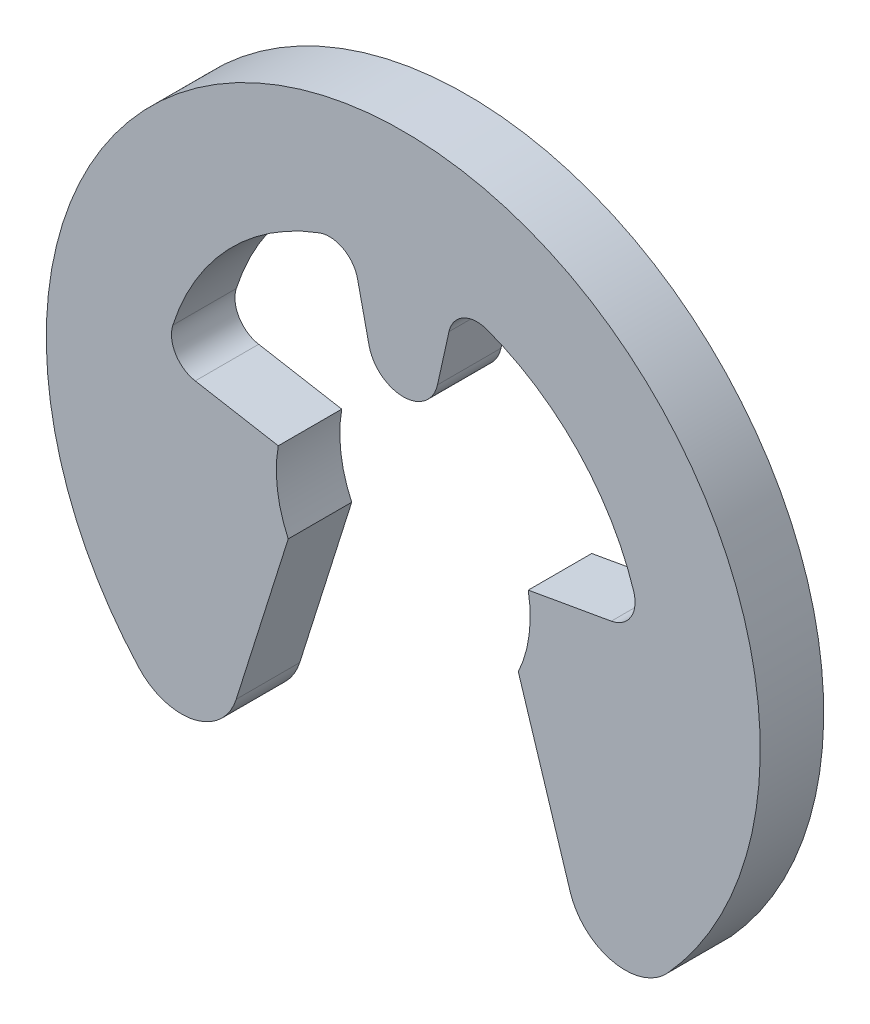
ISO-10303-21;
HEADER;
FILE_DESCRIPTION(('STEP AP214'),'2;1');
FILE_NAME('part.step','',(''),(''),'','','');
FILE_SCHEMA(('AUTOMOTIVE_DESIGN { 1 0 10303 214 1 1 1 1 }'));
ENDSEC;
DATA;
#1=APPLICATION_CONTEXT('core data for automotive mechanical design processes');
#2=APPLICATION_PROTOCOL_DEFINITION('international standard','automotive_design',2000,#1);
#3=PRODUCT_CONTEXT('',#1,'mechanical');
#4=PRODUCT('Part','Part','',(#3));
#5=PRODUCT_RELATED_PRODUCT_CATEGORY('part','',(#4));
#6=PRODUCT_DEFINITION_FORMATION('','',#4);
#7=PRODUCT_DEFINITION_CONTEXT('part definition',#1,'design');
#8=PRODUCT_DEFINITION('design','',#6,#7);
#9=PRODUCT_DEFINITION_SHAPE('','',#8);
#10=(LENGTH_UNIT() NAMED_UNIT(*) SI_UNIT(.MILLI.,.METRE.));
#11=(NAMED_UNIT(*) PLANE_ANGLE_UNIT() SI_UNIT($,.RADIAN.));
#12=(NAMED_UNIT(*) SI_UNIT($,.STERADIAN.) SOLID_ANGLE_UNIT());
#13=UNCERTAINTY_MEASURE_WITH_UNIT(LENGTH_MEASURE(1.E-05),#10,'distance_accuracy_value','');
#14=(GEOMETRIC_REPRESENTATION_CONTEXT(3) GLOBAL_UNCERTAINTY_ASSIGNED_CONTEXT((#13)) GLOBAL_UNIT_ASSIGNED_CONTEXT((#10,
#11,#12)) REPRESENTATION_CONTEXT('',''));
#15=CARTESIAN_POINT('',(0.,0.,0.));
#16=DIRECTION('',(0.,0.,1.));
#17=DIRECTION('',(1.,0.,0.));
#18=AXIS2_PLACEMENT_3D('',#15,#16,#17);
#19=CARTESIAN_POINT('',(0.,0.,-0.2));
#20=DIRECTION('',(0.,0.,1.));
#21=DIRECTION('',(1.,0.,0.));
#22=AXIS2_PLACEMENT_3D('',#19,#20,#21);
#23=CYLINDRICAL_SURFACE('',#22,0.399999999999999);
#24=CARTESIAN_POINT('',(0.,0.,0.));
#25=DIRECTION('',(0.,0.,-1.));
#26=DIRECTION('',(1.,0.,0.));
#27=AXIS2_PLACEMENT_3D('',#24,#25,#26);
#28=CIRCLE('',#27,0.399999999999999);
#29=CARTESIAN_POINT('',(0.393923101204882,0.069459271066771,0.));
#30=VERTEX_POINT('',#29);
#31=CARTESIAN_POINT('',(0.36252311481466,-0.169047304696281,0.));
#32=VERTEX_POINT('',#31);
#33=EDGE_CURVE('E190',#30,#32,#28,.T.);
#34=ORIENTED_EDGE('',*,*,#33,.F.);
#35=DIRECTION('',(0.,0.,1.));
#36=VECTOR('',#35,1.);
#37=CARTESIAN_POINT('',(0.393923101204882,0.069459271066771,-0.2));
#38=LINE('',#37,#36);
#39=CARTESIAN_POINT('',(0.393923101204882,0.069459271066771,-0.2));
#40=VERTEX_POINT('',#39);
#41=EDGE_CURVE('E11',#40,#30,#38,.T.);
#42=ORIENTED_EDGE('',*,*,#41,.F.);
#43=CARTESIAN_POINT('',(0.,0.,-0.2));
#44=DIRECTION('',(0.,0.,-1.));
#45=DIRECTION('',(1.,0.,0.));
#46=AXIS2_PLACEMENT_3D('',#43,#44,#45);
#47=CIRCLE('',#46,0.399999999999999);
#48=CARTESIAN_POINT('',(0.36252311481466,-0.169047304696281,-0.2));
#49=VERTEX_POINT('',#48);
#50=EDGE_CURVE('E240',#40,#49,#47,.T.);
#51=ORIENTED_EDGE('',*,*,#50,.T.);
#52=DIRECTION('',(0.,0.,1.));
#53=VECTOR('',#52,1.);
#54=CARTESIAN_POINT('',(0.36252311481466,-0.169047304696281,-0.2));
#55=LINE('',#54,#53);
#56=EDGE_CURVE('E36',#49,#32,#55,.T.);
#57=ORIENTED_EDGE('',*,*,#56,.T.);
#58=EDGE_LOOP('',(#34,#42,#51,#57));
#59=FACE_BOUND('',#58,.T.);
#60=ADVANCED_FACE('F33',(#59),#23,.F.);
#61=CARTESIAN_POINT('',(0.393923101204882,0.069459271066771,-0.2));
#62=DIRECTION('',(-0.173648177666926,0.984807753012209,0.));
#63=DIRECTION('',(-0.984807753012209,-0.173648177666926,0.));
#64=AXIS2_PLACEMENT_3D('',#61,#62,#63);
#65=PLANE('',#64);
#66=DIRECTION('',(-0.984807753012209,-0.173648177666927,0.));
#67=VECTOR('',#66,1.);
#68=CARTESIAN_POINT('',(0.393923101204882,0.069459271066771,0.));
#69=LINE('',#68,#67);
#70=CARTESIAN_POINT('',(0.655621015172542,0.115603674094391,0.));
#71=VERTEX_POINT('',#70);
#72=EDGE_CURVE('E238',#71,#30,#69,.T.);
#73=ORIENTED_EDGE('',*,*,#72,.F.);
#74=DIRECTION('',(0.,0.,1.));
#75=VECTOR('',#74,1.);
#76=CARTESIAN_POINT('',(0.655621015172542,0.115603674094391,-0.2));
#77=LINE('',#76,#75);
#78=CARTESIAN_POINT('',(0.655621015172542,0.115603674094391,-0.2));
#79=VERTEX_POINT('',#78);
#80=EDGE_CURVE('E42',#79,#71,#77,.T.);
#81=ORIENTED_EDGE('',*,*,#80,.F.);
#82=DIRECTION('',(-0.984807753012209,-0.173648177666927,0.));
#83=VECTOR('',#82,1.);
#84=CARTESIAN_POINT('',(0.393923101204882,0.069459271066771,-0.2));
#85=LINE('',#84,#83);
#86=EDGE_CURVE('E180',#79,#40,#85,.T.);
#87=ORIENTED_EDGE('',*,*,#86,.T.);
#88=ORIENTED_EDGE('',*,*,#41,.T.);
#89=EDGE_LOOP('',(#73,#81,#87,#88));
#90=FACE_BOUND('',#89,.T.);
#91=ADVANCED_FACE('F272',(#90),#65,.T.);
#92=CARTESIAN_POINT('',(0.639884149071478,0.204851876711123,-0.2));
#93=DIRECTION('',(0.,0.,1.));
#94=DIRECTION('',(1.,0.,0.));
#95=AXIS2_PLACEMENT_3D('',#92,#93,#94);
#96=CYLINDRICAL_SURFACE('',#95,0.0906250000000004);
#97=CARTESIAN_POINT('',(0.639884149071478,0.204851876711123,0.));
#98=DIRECTION('',(0.,0.,-1.));
#99=DIRECTION('',(1.,0.,0.));
#100=AXIS2_PLACEMENT_3D('',#97,#98,#99);
#101=CIRCLE('',#100,0.0906250000000004);
#102=CARTESIAN_POINT('',(0.726194104062515,0.23248306008146,0.));
#103=VERTEX_POINT('',#102);
#104=EDGE_CURVE('E167',#103,#71,#101,.T.);
#105=ORIENTED_EDGE('',*,*,#104,.F.);
#106=DIRECTION('',(0.,0.,1.));
#107=VECTOR('',#106,1.);
#108=CARTESIAN_POINT('',(0.726194104062515,0.23248306008146,-0.2));
#109=LINE('',#108,#107);
#110=CARTESIAN_POINT('',(0.726194104062515,0.23248306008146,-0.2));
#111=VERTEX_POINT('',#110);
#112=EDGE_CURVE('E162',#111,#103,#109,.T.);
#113=ORIENTED_EDGE('',*,*,#112,.F.);
#114=CARTESIAN_POINT('',(0.639884149071478,0.204851876711123,-0.2));
#115=DIRECTION('',(0.,0.,-1.));
#116=DIRECTION('',(1.,0.,0.));
#117=AXIS2_PLACEMENT_3D('',#114,#115,#116);
#118=CIRCLE('',#117,0.0906250000000004);
#119=EDGE_CURVE('E165',#111,#79,#118,.T.);
#120=ORIENTED_EDGE('',*,*,#119,.T.);
#121=ORIENTED_EDGE('',*,*,#80,.T.);
#122=EDGE_LOOP('',(#105,#113,#120,#121));
#123=FACE_BOUND('',#122,.T.);
#124=ADVANCED_FACE('F164',(#123),#96,.F.);
#125=CARTESIAN_POINT('',(0.,0.,-0.2));
#126=DIRECTION('',(0.,0.,1.));
#127=DIRECTION('',(1.,0.,0.));
#128=AXIS2_PLACEMENT_3D('',#125,#126,#127);
#129=CYLINDRICAL_SURFACE('',#128,0.7625);
#130=CARTESIAN_POINT('',(0.,0.,0.));
#131=DIRECTION('',(0.,0.,-1.));
#132=DIRECTION('',(1.,0.,0.));
#133=AXIS2_PLACEMENT_3D('',#130,#131,#132);
#134=CIRCLE('',#133,0.7625);
#135=CARTESIAN_POINT('',(0.26393792964982,0.715362159533314,0.));
#136=VERTEX_POINT('',#135);
#137=EDGE_CURVE('E235',#136,#103,#134,.T.);
#138=ORIENTED_EDGE('',*,*,#137,.F.);
#139=DIRECTION('',(0.,0.,1.));
#140=VECTOR('',#139,1.);
#141=CARTESIAN_POINT('',(0.26393792964982,0.715362159533314,-0.2));
#142=LINE('',#141,#140);
#143=CARTESIAN_POINT('',(0.26393792964982,0.715362159533314,-0.2));
#144=VERTEX_POINT('',#143);
#145=EDGE_CURVE('E172',#144,#136,#142,.T.);
#146=ORIENTED_EDGE('',*,*,#145,.F.);
#147=CARTESIAN_POINT('',(0.,0.,-0.2));
#148=DIRECTION('',(0.,0.,-1.));
#149=DIRECTION('',(1.,0.,0.));
#150=AXIS2_PLACEMENT_3D('',#147,#148,#149);
#151=CIRCLE('',#150,0.7625);
#152=EDGE_CURVE('E178',#144,#111,#151,.T.);
#153=ORIENTED_EDGE('',*,*,#152,.T.);
#154=ORIENTED_EDGE('',*,*,#112,.T.);
#155=EDGE_LOOP('',(#138,#146,#153,#154));
#156=FACE_BOUND('',#155,.T.);
#157=ADVANCED_FACE('F182',(#156),#129,.F.);
#158=CARTESIAN_POINT('',(0.232568257683243,0.630339607785501,-0.2));
#159=DIRECTION('',(0.,0.,1.));
#160=DIRECTION('',(1.,0.,0.));
#161=AXIS2_PLACEMENT_3D('',#158,#159,#160);
#162=CYLINDRICAL_SURFACE('',#161,0.0906250000000003);
#163=CARTESIAN_POINT('',(0.232568257683243,0.630339607785501,0.));
#164=DIRECTION('',(0.,0.,-1.));
#165=DIRECTION('',(1.,0.,0.));
#166=AXIS2_PLACEMENT_3D('',#163,#164,#165);
#167=CIRCLE('',#166,0.0906250000000003);
#168=CARTESIAN_POINT('',(0.144091432037999,0.649954447798643,0.));
#169=VERTEX_POINT('',#168);
#170=EDGE_CURVE('E232',#169,#136,#167,.T.);
#171=ORIENTED_EDGE('',*,*,#170,.F.);
#172=DIRECTION('',(0.,0.,1.));
#173=VECTOR('',#172,1.);
#174=CARTESIAN_POINT('',(0.144091432037999,0.649954447798643,-0.2));
#175=LINE('',#174,#173);
#176=CARTESIAN_POINT('',(0.144091432037999,0.649954447798643,-0.2));
#177=VERTEX_POINT('',#176);
#178=EDGE_CURVE('E244',#177,#169,#175,.T.);
#179=ORIENTED_EDGE('',*,*,#178,.F.);
#180=CARTESIAN_POINT('',(0.232568257683243,0.630339607785501,-0.2));
#181=DIRECTION('',(0.,0.,-1.));
#182=DIRECTION('',(1.,0.,0.));
#183=AXIS2_PLACEMENT_3D('',#180,#181,#182);
#184=CIRCLE('',#183,0.0906250000000003);
#185=EDGE_CURVE('E183',#177,#144,#184,.T.);
#186=ORIENTED_EDGE('',*,*,#185,.T.);
#187=ORIENTED_EDGE('',*,*,#145,.T.);
#188=EDGE_LOOP('',(#171,#179,#186,#187));
#189=FACE_BOUND('',#188,.T.);
#190=ADVANCED_FACE('F285',(#189),#162,.F.);
#191=CARTESIAN_POINT('',(0.107871267935006,0.486575845575241,-0.2));
#192=DIRECTION('',(0.976296007119932,-0.216439613938109,0.));
#193=DIRECTION('',(0.216439613938109,0.976296007119932,0.));
#194=AXIS2_PLACEMENT_3D('',#191,#192,#193);
#195=PLANE('',#194);
#196=DIRECTION('',(0.216439613938109,0.976296007119932,0.));
#197=VECTOR('',#196,1.);
#198=CARTESIAN_POINT('',(0.107871267935006,0.486575845575241,0.));
#199=LINE('',#198,#197);
#200=CARTESIAN_POINT('',(0.107871267935006,0.486575845575241,0.));
#201=VERTEX_POINT('',#200);
#202=EDGE_CURVE('E229',#201,#169,#199,.T.);
#203=ORIENTED_EDGE('',*,*,#202,.F.);
#204=DIRECTION('',(0.,0.,1.));
#205=VECTOR('',#204,1.);
#206=CARTESIAN_POINT('',(0.107871267935006,0.486575845575241,-0.2));
#207=LINE('',#206,#205);
#208=CARTESIAN_POINT('',(0.107871267935006,0.486575845575241,-0.2));
#209=VERTEX_POINT('',#208);
#210=EDGE_CURVE('E246',#209,#201,#207,.T.);
#211=ORIENTED_EDGE('',*,*,#210,.F.);
#212=DIRECTION('',(0.216439613938109,0.976296007119932,0.));
#213=VECTOR('',#212,1.);
#214=CARTESIAN_POINT('',(0.107871267935006,0.486575845575241,-0.2));
#215=LINE('',#214,#213);
#216=EDGE_CURVE('E185',#209,#177,#215,.T.);
#217=ORIENTED_EDGE('',*,*,#216,.T.);
#218=ORIENTED_EDGE('',*,*,#178,.T.);
#219=EDGE_LOOP('',(#203,#211,#217,#218));
#220=FACE_BOUND('',#219,.T.);
#221=ADVANCED_FACE('F288',(#220),#195,.T.);
#222=CARTESIAN_POINT('',(0.,0.510490329928958,-0.2));
#223=DIRECTION('',(0.,0.,1.));
#224=DIRECTION('',(1.,0.,0.));
#225=AXIS2_PLACEMENT_3D('',#222,#223,#224);
#226=CYLINDRICAL_SURFACE('',#225,0.110490329928959);
#227=CARTESIAN_POINT('',(0.,0.510490329928958,0.));
#228=DIRECTION('',(0.,0.,1.));
#229=DIRECTION('',(1.,0.,0.));
#230=AXIS2_PLACEMENT_3D('',#227,#228,#229);
#231=CIRCLE('',#230,0.110490329928959);
#232=CARTESIAN_POINT('',(-0.107871267935006,0.486575845575241,0.));
#233=VERTEX_POINT('',#232);
#234=EDGE_CURVE('E226',#233,#201,#231,.T.);
#235=ORIENTED_EDGE('',*,*,#234,.F.);
#236=DIRECTION('',(0.,0.,1.));
#237=VECTOR('',#236,1.);
#238=CARTESIAN_POINT('',(-0.107871267935006,0.486575845575241,-0.2));
#239=LINE('',#238,#237);
#240=CARTESIAN_POINT('',(-0.107871267935006,0.486575845575241,-0.2));
#241=VERTEX_POINT('',#240);
#242=EDGE_CURVE('E248',#241,#233,#239,.T.);
#243=ORIENTED_EDGE('',*,*,#242,.F.);
#244=CARTESIAN_POINT('',(0.,0.510490329928958,-0.2));
#245=DIRECTION('',(0.,0.,1.));
#246=DIRECTION('',(1.,0.,0.));
#247=AXIS2_PLACEMENT_3D('',#244,#245,#246);
#248=CIRCLE('',#247,0.110490329928959);
#249=EDGE_CURVE('E496',#241,#209,#248,.T.);
#250=ORIENTED_EDGE('',*,*,#249,.T.);
#251=ORIENTED_EDGE('',*,*,#210,.T.);
#252=EDGE_LOOP('',(#235,#243,#250,#251));
#253=FACE_BOUND('',#252,.T.);
#254=ADVANCED_FACE('F292',(#253),#226,.T.);
#255=CARTESIAN_POINT('',(-0.107871267935007,0.486575845575241,-0.2));
#256=DIRECTION('',(-0.976296007119933,-0.216439613938104,0.));
#257=DIRECTION('',(0.216439613938104,-0.976296007119933,0.));
#258=AXIS2_PLACEMENT_3D('',#255,#256,#257);
#259=PLANE('',#258);
#260=DIRECTION('',(0.216439613938104,-0.976296007119933,0.));
#261=VECTOR('',#260,1.);
#262=CARTESIAN_POINT('',(-0.107871267935007,0.486575845575241,0.));
#263=LINE('',#262,#261);
#264=CARTESIAN_POINT('',(-0.144091432037999,0.649954447798643,0.));
#265=VERTEX_POINT('',#264);
#266=EDGE_CURVE('E223',#265,#233,#263,.T.);
#267=ORIENTED_EDGE('',*,*,#266,.F.);
#268=DIRECTION('',(0.,0.,1.));
#269=VECTOR('',#268,1.);
#270=CARTESIAN_POINT('',(-0.144091432037999,0.649954447798643,-0.2));
#271=LINE('',#270,#269);
#272=CARTESIAN_POINT('',(-0.144091432037999,0.649954447798643,-0.2));
#273=VERTEX_POINT('',#272);
#274=EDGE_CURVE('E250',#273,#265,#271,.T.);
#275=ORIENTED_EDGE('',*,*,#274,.F.);
#276=DIRECTION('',(0.216439613938104,-0.976296007119933,0.));
#277=VECTOR('',#276,1.);
#278=CARTESIAN_POINT('',(-0.107871267935007,0.486575845575241,-0.2));
#279=LINE('',#278,#277);
#280=EDGE_CURVE('E500',#273,#241,#279,.T.);
#281=ORIENTED_EDGE('',*,*,#280,.T.);
#282=ORIENTED_EDGE('',*,*,#242,.T.);
#283=EDGE_LOOP('',(#267,#275,#281,#282));
#284=FACE_BOUND('',#283,.T.);
#285=ADVANCED_FACE('F296',(#284),#259,.T.);
#286=CARTESIAN_POINT('',(-0.232568257683243,0.630339607785501,-0.2));
#287=DIRECTION('',(0.,0.,1.));
#288=DIRECTION('',(1.,0.,0.));
#289=AXIS2_PLACEMENT_3D('',#286,#287,#288);
#290=CYLINDRICAL_SURFACE('',#289,0.0906250000000003);
#291=CARTESIAN_POINT('',(-0.232568257683243,0.630339607785501,0.));
#292=DIRECTION('',(0.,0.,-1.));
#293=DIRECTION('',(1.,0.,0.));
#294=AXIS2_PLACEMENT_3D('',#291,#292,#293);
#295=CIRCLE('',#294,0.0906250000000003);
#296=CARTESIAN_POINT('',(-0.26393792964982,0.715362159533313,0.));
#297=VERTEX_POINT('',#296);
#298=EDGE_CURVE('E220',#297,#265,#295,.T.);
#299=ORIENTED_EDGE('',*,*,#298,.F.);
#300=DIRECTION('',(0.,0.,1.));
#301=VECTOR('',#300,1.);
#302=CARTESIAN_POINT('',(-0.26393792964982,0.715362159533313,-0.2));
#303=LINE('',#302,#301);
#304=CARTESIAN_POINT('',(-0.26393792964982,0.715362159533313,-0.2));
#305=VERTEX_POINT('',#304);
#306=EDGE_CURVE('E252',#305,#297,#303,.T.);
#307=ORIENTED_EDGE('',*,*,#306,.F.);
#308=CARTESIAN_POINT('',(-0.232568257683243,0.630339607785501,-0.2));
#309=DIRECTION('',(0.,0.,-1.));
#310=DIRECTION('',(1.,0.,0.));
#311=AXIS2_PLACEMENT_3D('',#308,#309,#310);
#312=CIRCLE('',#311,0.0906250000000003);
#313=EDGE_CURVE('E489',#305,#273,#312,.T.);
#314=ORIENTED_EDGE('',*,*,#313,.T.);
#315=ORIENTED_EDGE('',*,*,#274,.T.);
#316=EDGE_LOOP('',(#299,#307,#314,#315));
#317=FACE_BOUND('',#316,.T.);
#318=ADVANCED_FACE('F300',(#317),#290,.F.);
#319=CARTESIAN_POINT('',(0.,0.,-0.2));
#320=DIRECTION('',(0.,0.,1.));
#321=DIRECTION('',(1.,0.,0.));
#322=AXIS2_PLACEMENT_3D('',#319,#320,#321);
#323=CYLINDRICAL_SURFACE('',#322,0.7625);
#324=CARTESIAN_POINT('',(0.,0.,0.));
#325=DIRECTION('',(0.,0.,-1.));
#326=DIRECTION('',(1.,0.,0.));
#327=AXIS2_PLACEMENT_3D('',#324,#325,#326);
#328=CIRCLE('',#327,0.7625);
#329=CARTESIAN_POINT('',(-0.726194104062515,0.23248306008146,0.));
#330=VERTEX_POINT('',#329);
#331=EDGE_CURVE('E217',#330,#297,#328,.T.);
#332=ORIENTED_EDGE('',*,*,#331,.F.);
#333=DIRECTION('',(0.,0.,1.));
#334=VECTOR('',#333,1.);
#335=CARTESIAN_POINT('',(-0.726194104062515,0.23248306008146,-0.2));
#336=LINE('',#335,#334);
#337=CARTESIAN_POINT('',(-0.726194104062515,0.23248306008146,-0.2));
#338=VERTEX_POINT('',#337);
#339=EDGE_CURVE('E254',#338,#330,#336,.T.);
#340=ORIENTED_EDGE('',*,*,#339,.F.);
#341=CARTESIAN_POINT('',(0.,0.,-0.2));
#342=DIRECTION('',(0.,0.,-1.));
#343=DIRECTION('',(1.,0.,0.));
#344=AXIS2_PLACEMENT_3D('',#341,#342,#343);
#345=CIRCLE('',#344,0.7625);
#346=EDGE_CURVE('E485',#338,#305,#345,.T.);
#347=ORIENTED_EDGE('',*,*,#346,.T.);
#348=ORIENTED_EDGE('',*,*,#306,.T.);
#349=EDGE_LOOP('',(#332,#340,#347,#348));
#350=FACE_BOUND('',#349,.T.);
#351=ADVANCED_FACE('F304',(#350),#323,.F.);
#352=CARTESIAN_POINT('',(-0.639884149071478,0.204851876711123,-0.2));
#353=DIRECTION('',(0.,0.,1.));
#354=DIRECTION('',(1.,0.,0.));
#355=AXIS2_PLACEMENT_3D('',#352,#353,#354);
#356=CYLINDRICAL_SURFACE('',#355,0.0906250000000004);
#357=CARTESIAN_POINT('',(-0.639884149071478,0.204851876711123,0.));
#358=DIRECTION('',(0.,0.,-1.));
#359=DIRECTION('',(1.,0.,0.));
#360=AXIS2_PLACEMENT_3D('',#357,#358,#359);
#361=CIRCLE('',#360,0.0906250000000004);
#362=CARTESIAN_POINT('',(-0.655621015172542,0.115603674094391,0.));
#363=VERTEX_POINT('',#362);
#364=EDGE_CURVE('E214',#363,#330,#361,.T.);
#365=ORIENTED_EDGE('',*,*,#364,.F.);
#366=DIRECTION('',(0.,0.,1.));
#367=VECTOR('',#366,1.);
#368=CARTESIAN_POINT('',(-0.655621015172542,0.115603674094391,-0.2));
#369=LINE('',#368,#367);
#370=CARTESIAN_POINT('',(-0.655621015172542,0.115603674094391,-0.2));
#371=VERTEX_POINT('',#370);
#372=EDGE_CURVE('E256',#371,#363,#369,.T.);
#373=ORIENTED_EDGE('',*,*,#372,.F.);
#374=CARTESIAN_POINT('',(-0.639884149071478,0.204851876711123,-0.2));
#375=DIRECTION('',(0.,0.,-1.));
#376=DIRECTION('',(1.,0.,0.));
#377=AXIS2_PLACEMENT_3D('',#374,#375,#376);
#378=CIRCLE('',#377,0.0906250000000004);
#379=EDGE_CURVE('E506',#371,#338,#378,.T.);
#380=ORIENTED_EDGE('',*,*,#379,.T.);
#381=ORIENTED_EDGE('',*,*,#339,.T.);
#382=EDGE_LOOP('',(#365,#373,#380,#381));
#383=FACE_BOUND('',#382,.T.);
#384=ADVANCED_FACE('F308',(#383),#356,.F.);
#385=CARTESIAN_POINT('',(-0.393923101204882,0.069459271066771,-0.2));
#386=DIRECTION('',(0.173648177666926,0.984807753012209,0.));
#387=DIRECTION('',(-0.984807753012209,0.173648177666926,0.));
#388=AXIS2_PLACEMENT_3D('',#385,#386,#387);
#389=PLANE('',#388);
#390=DIRECTION('',(-0.984807753012209,0.173648177666927,0.));
#391=VECTOR('',#390,1.);
#392=CARTESIAN_POINT('',(-0.393923101204882,0.069459271066771,0.));
#393=LINE('',#392,#391);
#394=CARTESIAN_POINT('',(-0.393923101204882,0.069459271066771,0.));
#395=VERTEX_POINT('',#394);
#396=EDGE_CURVE('E211',#395,#363,#393,.T.);
#397=ORIENTED_EDGE('',*,*,#396,.F.);
#398=DIRECTION('',(0.,0.,1.));
#399=VECTOR('',#398,1.);
#400=CARTESIAN_POINT('',(-0.393923101204882,0.069459271066771,-0.2));
#401=LINE('',#400,#399);
#402=CARTESIAN_POINT('',(-0.393923101204882,0.069459271066771,-0.2));
#403=VERTEX_POINT('',#402);
#404=EDGE_CURVE('E258',#403,#395,#401,.T.);
#405=ORIENTED_EDGE('',*,*,#404,.F.);
#406=DIRECTION('',(-0.984807753012209,0.173648177666927,0.));
#407=VECTOR('',#406,1.);
#408=CARTESIAN_POINT('',(-0.393923101204882,0.069459271066771,-0.2));
#409=LINE('',#408,#407);
#410=EDGE_CURVE('E478',#403,#371,#409,.T.);
#411=ORIENTED_EDGE('',*,*,#410,.T.);
#412=ORIENTED_EDGE('',*,*,#372,.T.);
#413=EDGE_LOOP('',(#397,#405,#411,#412));
#414=FACE_BOUND('',#413,.T.);
#415=ADVANCED_FACE('F312',(#414),#389,.T.);
#416=CARTESIAN_POINT('',(0.,0.,-0.2));
#417=DIRECTION('',(0.,0.,1.));
#418=DIRECTION('',(1.,0.,0.));
#419=AXIS2_PLACEMENT_3D('',#416,#417,#418);
#420=CYLINDRICAL_SURFACE('',#419,0.399999999999999);
#421=CARTESIAN_POINT('',(0.,0.,0.));
#422=DIRECTION('',(0.,0.,-1.));
#423=DIRECTION('',(1.,0.,0.));
#424=AXIS2_PLACEMENT_3D('',#421,#422,#423);
#425=CIRCLE('',#424,0.399999999999999);
#426=CARTESIAN_POINT('',(-0.362523114814659,-0.169047304696281,0.));
#427=VERTEX_POINT('',#426);
#428=EDGE_CURVE('E208',#427,#395,#425,.T.);
#429=ORIENTED_EDGE('',*,*,#428,.F.);
#430=DIRECTION('',(0.,0.,1.));
#431=VECTOR('',#430,1.);
#432=CARTESIAN_POINT('',(-0.362523114814659,-0.169047304696281,-0.2));
#433=LINE('',#432,#431);
#434=CARTESIAN_POINT('',(-0.362523114814659,-0.169047304696281,-0.2));
#435=VERTEX_POINT('',#434);
#436=EDGE_CURVE('E260',#435,#427,#433,.T.);
#437=ORIENTED_EDGE('',*,*,#436,.F.);
#438=CARTESIAN_POINT('',(0.,0.,-0.2));
#439=DIRECTION('',(0.,0.,-1.));
#440=DIRECTION('',(1.,0.,0.));
#441=AXIS2_PLACEMENT_3D('',#438,#439,#440);
#442=CIRCLE('',#441,0.399999999999999);
#443=EDGE_CURVE('E474',#435,#403,#442,.T.);
#444=ORIENTED_EDGE('',*,*,#443,.T.);
#445=ORIENTED_EDGE('',*,*,#404,.T.);
#446=EDGE_LOOP('',(#429,#437,#444,#445));
#447=FACE_BOUND('',#446,.T.);
#448=ADVANCED_FACE('F316',(#447),#420,.F.);
#449=CARTESIAN_POINT('',(-0.36252311481466,-0.169047304696281,-0.2));
#450=DIRECTION('',(0.953716950748226,-0.300705799504276,0.));
#451=DIRECTION('',(0.300705799504276,0.953716950748226,0.));
#452=AXIS2_PLACEMENT_3D('',#449,#450,#451);
#453=PLANE('',#452);
#454=DIRECTION('',(0.300705799504276,0.953716950748226,0.));
#455=VECTOR('',#454,1.);
#456=CARTESIAN_POINT('',(-0.36252311481466,-0.169047304696281,0.));
#457=LINE('',#456,#455);
#458=CARTESIAN_POINT('',(-0.526283246387881,-0.688428086828221,0.));
#459=VERTEX_POINT('',#458);
#460=EDGE_CURVE('E205',#459,#427,#457,.T.);
#461=ORIENTED_EDGE('',*,*,#460,.F.);
#462=DIRECTION('',(0.,0.,1.));
#463=VECTOR('',#462,1.);
#464=CARTESIAN_POINT('',(-0.526283246387881,-0.688428086828221,-0.2));
#465=LINE('',#464,#463);
#466=CARTESIAN_POINT('',(-0.526283246387881,-0.688428086828221,-0.2));
#467=VERTEX_POINT('',#466);
#468=EDGE_CURVE('E262',#467,#459,#465,.T.);
#469=ORIENTED_EDGE('',*,*,#468,.F.);
#470=DIRECTION('',(0.300705799504276,0.953716950748226,0.));
#471=VECTOR('',#470,1.);
#472=CARTESIAN_POINT('',(-0.36252311481466,-0.169047304696281,-0.2));
#473=LINE('',#472,#471);
#474=EDGE_CURVE('E510',#467,#435,#473,.T.);
#475=ORIENTED_EDGE('',*,*,#474,.T.);
#476=ORIENTED_EDGE('',*,*,#436,.T.);
#477=EDGE_LOOP('',(#461,#469,#475,#476));
#478=FACE_BOUND('',#477,.T.);
#479=ADVANCED_FACE('F320',(#478),#453,.T.);
#480=CARTESIAN_POINT('',(-0.699144443710999,-0.633925160668071,-0.2));
#481=DIRECTION('',(0.,0.,1.));
#482=DIRECTION('',(1.,0.,0.));
#483=AXIS2_PLACEMENT_3D('',#480,#481,#482);
#484=CYLINDRICAL_SURFACE('',#483,0.181250000000001);
#485=CARTESIAN_POINT('',(-0.699144443710999,-0.633925160668071,0.));
#486=DIRECTION('',(0.,0.,1.));
#487=DIRECTION('',(1.,0.,0.));
#488=AXIS2_PLACEMENT_3D('',#485,#486,#487);
#489=CIRCLE('',#488,0.181250000000001);
#490=CARTESIAN_POINT('',(-0.833417217668741,-0.755672376955317,0.));
#491=VERTEX_POINT('',#490);
#492=EDGE_CURVE('E202',#491,#459,#489,.T.);
#493=ORIENTED_EDGE('',*,*,#492,.F.);
#494=DIRECTION('',(0.,0.,1.));
#495=VECTOR('',#494,1.);
#496=CARTESIAN_POINT('',(-0.833417217668741,-0.755672376955317,-0.2));
#497=LINE('',#496,#495);
#498=CARTESIAN_POINT('',(-0.833417217668741,-0.755672376955317,-0.2));
#499=VERTEX_POINT('',#498);
#500=EDGE_CURVE('E264',#499,#491,#497,.T.);
#501=ORIENTED_EDGE('',*,*,#500,.F.);
#502=CARTESIAN_POINT('',(-0.699144443710999,-0.633925160668071,-0.2));
#503=DIRECTION('',(0.,0.,1.));
#504=DIRECTION('',(1.,0.,0.));
#505=AXIS2_PLACEMENT_3D('',#502,#503,#504);
#506=CIRCLE('',#505,0.181250000000001);
#507=EDGE_CURVE('E467',#499,#467,#506,.T.);
#508=ORIENTED_EDGE('',*,*,#507,.T.);
#509=ORIENTED_EDGE('',*,*,#468,.T.);
#510=EDGE_LOOP('',(#493,#501,#508,#509));
#511=FACE_BOUND('',#510,.T.);
#512=ADVANCED_FACE('F324',(#511),#484,.T.);
#513=CARTESIAN_POINT('',(0.,0.,-0.2));
#514=DIRECTION('',(0.,0.,1.));
#515=DIRECTION('',(1.,0.,0.));
#516=AXIS2_PLACEMENT_3D('',#513,#514,#515);
#517=CYLINDRICAL_SURFACE('',#516,1.125);
#518=CARTESIAN_POINT('',(0.,0.,0.));
#519=DIRECTION('',(0.,0.,1.));
#520=DIRECTION('',(1.,0.,0.));
#521=AXIS2_PLACEMENT_3D('',#518,#519,#520);
#522=CIRCLE('',#521,1.125);
#523=CARTESIAN_POINT('',(0.83341721766874,-0.755672376955317,0.));
#524=VERTEX_POINT('',#523);
#525=EDGE_CURVE('E199',#524,#491,#522,.T.);
#526=ORIENTED_EDGE('',*,*,#525,.F.);
#527=DIRECTION('',(0.,0.,1.));
#528=VECTOR('',#527,1.);
#529=CARTESIAN_POINT('',(0.83341721766874,-0.755672376955317,-0.2));
#530=LINE('',#529,#528);
#531=CARTESIAN_POINT('',(0.83341721766874,-0.755672376955317,-0.2));
#532=VERTEX_POINT('',#531);
#533=EDGE_CURVE('E266',#532,#524,#530,.T.);
#534=ORIENTED_EDGE('',*,*,#533,.F.);
#535=CARTESIAN_POINT('',(0.,0.,-0.2));
#536=DIRECTION('',(0.,0.,1.));
#537=DIRECTION('',(1.,0.,0.));
#538=AXIS2_PLACEMENT_3D('',#535,#536,#537);
#539=CIRCLE('',#538,1.125);
#540=EDGE_CURVE('E463',#532,#499,#539,.T.);
#541=ORIENTED_EDGE('',*,*,#540,.T.);
#542=ORIENTED_EDGE('',*,*,#500,.T.);
#543=EDGE_LOOP('',(#526,#534,#541,#542));
#544=FACE_BOUND('',#543,.T.);
#545=ADVANCED_FACE('F328',(#544),#517,.T.);
#546=CARTESIAN_POINT('',(0.699144443710999,-0.633925160668071,-0.2));
#547=DIRECTION('',(0.,0.,1.));
#548=DIRECTION('',(1.,0.,0.));
#549=AXIS2_PLACEMENT_3D('',#546,#547,#548);
#550=CYLINDRICAL_SURFACE('',#549,0.181250000000001);
#551=CARTESIAN_POINT('',(0.699144443710999,-0.633925160668071,0.));
#552=DIRECTION('',(0.,0.,1.));
#553=DIRECTION('',(1.,0.,0.));
#554=AXIS2_PLACEMENT_3D('',#551,#552,#553);
#555=CIRCLE('',#554,0.181250000000001);
#556=CARTESIAN_POINT('',(0.526283246387882,-0.688428086828221,0.));
#557=VERTEX_POINT('',#556);
#558=EDGE_CURVE('E196',#557,#524,#555,.T.);
#559=ORIENTED_EDGE('',*,*,#558,.F.);
#560=DIRECTION('',(0.,0.,1.));
#561=VECTOR('',#560,1.);
#562=CARTESIAN_POINT('',(0.526283246387882,-0.688428086828221,-0.2));
#563=LINE('',#562,#561);
#564=CARTESIAN_POINT('',(0.526283246387882,-0.688428086828221,-0.2));
#565=VERTEX_POINT('',#564);
#566=EDGE_CURVE('E267',#565,#557,#563,.T.);
#567=ORIENTED_EDGE('',*,*,#566,.F.);
#568=CARTESIAN_POINT('',(0.699144443710999,-0.633925160668071,-0.2));
#569=DIRECTION('',(0.,0.,1.));
#570=DIRECTION('',(1.,0.,0.));
#571=AXIS2_PLACEMENT_3D('',#568,#569,#570);
#572=CIRCLE('',#571,0.181250000000001);
#573=EDGE_CURVE('E514',#565,#532,#572,.T.);
#574=ORIENTED_EDGE('',*,*,#573,.T.);
#575=ORIENTED_EDGE('',*,*,#533,.T.);
#576=EDGE_LOOP('',(#559,#567,#574,#575));
#577=FACE_BOUND('',#576,.T.);
#578=ADVANCED_FACE('F332',(#577),#550,.T.);
#579=CARTESIAN_POINT('',(0.36252311481466,-0.169047304696281,-0.2));
#580=DIRECTION('',(-0.953716950748226,-0.300705799504276,0.));
#581=DIRECTION('',(0.300705799504276,-0.953716950748226,0.));
#582=AXIS2_PLACEMENT_3D('',#579,#580,#581);
#583=PLANE('',#582);
#584=DIRECTION('',(0.300705799504276,-0.953716950748226,0.));
#585=VECTOR('',#584,1.);
#586=CARTESIAN_POINT('',(0.36252311481466,-0.169047304696281,0.));
#587=LINE('',#586,#585);
#588=EDGE_CURVE('E193',#32,#557,#587,.T.);
#589=ORIENTED_EDGE('',*,*,#588,.F.);
#590=ORIENTED_EDGE('',*,*,#56,.F.);
#591=DIRECTION('',(0.300705799504276,-0.953716950748226,0.));
#592=VECTOR('',#591,1.);
#593=CARTESIAN_POINT('',(0.36252311481466,-0.169047304696281,-0.2));
#594=LINE('',#593,#592);
#595=EDGE_CURVE('E516',#49,#565,#594,.T.);
#596=ORIENTED_EDGE('',*,*,#595,.T.);
#597=ORIENTED_EDGE('',*,*,#566,.T.);
#598=EDGE_LOOP('',(#589,#590,#596,#597));
#599=FACE_BOUND('',#598,.T.);
#600=ADVANCED_FACE('F269',(#599),#583,.T.);
#601=CARTESIAN_POINT('',(0.,0.,-0.2));
#602=DIRECTION('',(0.,0.,1.));
#603=DIRECTION('',(1.,0.,0.));
#604=AXIS2_PLACEMENT_3D('',#601,#602,#603);
#605=PLANE('',#604);
#606=ORIENTED_EDGE('',*,*,#50,.F.);
#607=ORIENTED_EDGE('',*,*,#86,.F.);
#608=ORIENTED_EDGE('',*,*,#119,.F.);
#609=ORIENTED_EDGE('',*,*,#152,.F.);
#610=ORIENTED_EDGE('',*,*,#185,.F.);
#611=ORIENTED_EDGE('',*,*,#216,.F.);
#612=ORIENTED_EDGE('',*,*,#249,.F.);
#613=ORIENTED_EDGE('',*,*,#280,.F.);
#614=ORIENTED_EDGE('',*,*,#313,.F.);
#615=ORIENTED_EDGE('',*,*,#346,.F.);
#616=ORIENTED_EDGE('',*,*,#379,.F.);
#617=ORIENTED_EDGE('',*,*,#410,.F.);
#618=ORIENTED_EDGE('',*,*,#443,.F.);
#619=ORIENTED_EDGE('',*,*,#474,.F.);
#620=ORIENTED_EDGE('',*,*,#507,.F.);
#621=ORIENTED_EDGE('',*,*,#540,.F.);
#622=ORIENTED_EDGE('',*,*,#573,.F.);
#623=ORIENTED_EDGE('',*,*,#595,.F.);
#624=EDGE_LOOP('',(#606,#607,#608,#609,#610,#611,#612,#613,#614,#615,#616,#617,#618,#619,#620,
#621,#622,#623));
#625=FACE_BOUND('',#624,.T.);
#626=ADVANCED_FACE('F176',(#625),#605,.F.);
#627=CARTESIAN_POINT('',(0.,0.,0.));
#628=DIRECTION('',(0.,0.,1.));
#629=DIRECTION('',(1.,0.,0.));
#630=AXIS2_PLACEMENT_3D('',#627,#628,#629);
#631=PLANE('',#630);
#632=ORIENTED_EDGE('',*,*,#33,.T.);
#633=ORIENTED_EDGE('',*,*,#588,.T.);
#634=ORIENTED_EDGE('',*,*,#558,.T.);
#635=ORIENTED_EDGE('',*,*,#525,.T.);
#636=ORIENTED_EDGE('',*,*,#492,.T.);
#637=ORIENTED_EDGE('',*,*,#460,.T.);
#638=ORIENTED_EDGE('',*,*,#428,.T.);
#639=ORIENTED_EDGE('',*,*,#396,.T.);
#640=ORIENTED_EDGE('',*,*,#364,.T.);
#641=ORIENTED_EDGE('',*,*,#331,.T.);
#642=ORIENTED_EDGE('',*,*,#298,.T.);
#643=ORIENTED_EDGE('',*,*,#266,.T.);
#644=ORIENTED_EDGE('',*,*,#234,.T.);
#645=ORIENTED_EDGE('',*,*,#202,.T.);
#646=ORIENTED_EDGE('',*,*,#170,.T.);
#647=ORIENTED_EDGE('',*,*,#137,.T.);
#648=ORIENTED_EDGE('',*,*,#104,.T.);
#649=ORIENTED_EDGE('',*,*,#72,.T.);
#650=EDGE_LOOP('',(#632,#633,#634,#635,#636,#637,#638,#639,#640,#641,#642,#643,#644,#645,#646,
#647,#648,#649));
#651=FACE_BOUND('',#650,.T.);
#652=ADVANCED_FACE('F271',(#651),#631,.T.);
#653=CLOSED_SHELL('',(#60,#91,#124,#157,#190,#221,#254,#285,#318,#351,#384,#415,#448,#479,#512,
#545,#578,#600,#626,#652));
#654=MANIFOLD_SOLID_BREP('B2',#653);
#655=ADVANCED_BREP_SHAPE_REPRESENTATION('',(#18,#654),#14);
#656=SHAPE_DEFINITION_REPRESENTATION(#9,#655);
ENDSEC;
END-ISO-10303-21;
